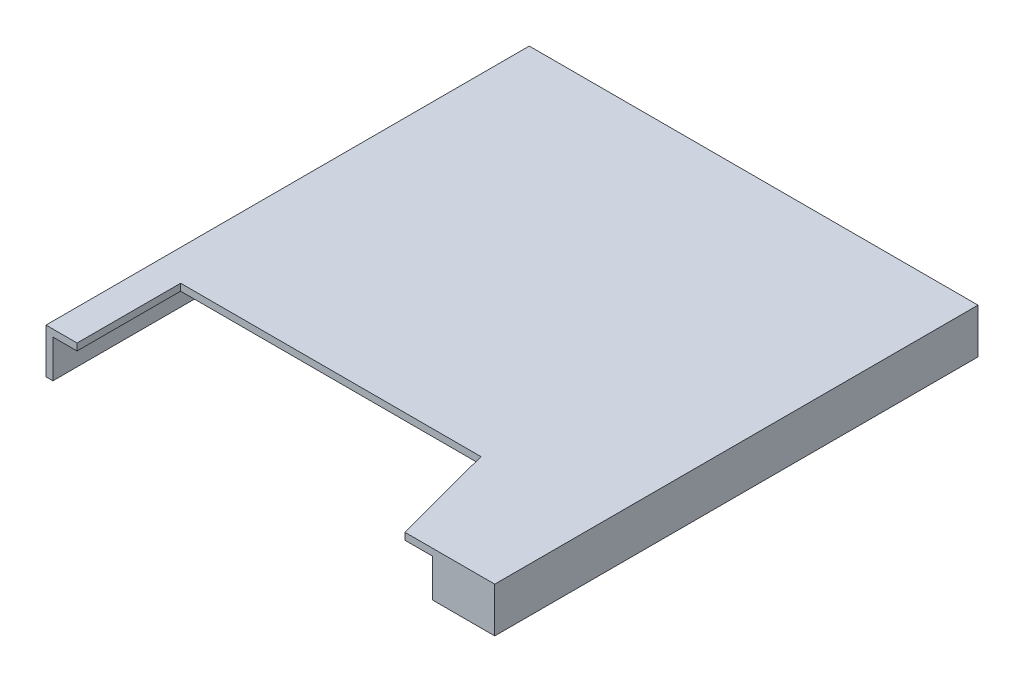
ISO-10303-21;
HEADER;
FILE_DESCRIPTION(('STEP AP214'),'2;1');
FILE_NAME('part.step','',(''),(''),'','','');
FILE_SCHEMA(('AUTOMOTIVE_DESIGN { 1 0 10303 214 1 1 1 1 }'));
ENDSEC;
DATA;
#1=APPLICATION_CONTEXT('core data for automotive mechanical design processes');
#2=APPLICATION_PROTOCOL_DEFINITION('international standard','automotive_design',2000,#1);
#3=PRODUCT_CONTEXT('',#1,'mechanical');
#4=PRODUCT('Part','Part','',(#3));
#5=PRODUCT_RELATED_PRODUCT_CATEGORY('part','',(#4));
#6=PRODUCT_DEFINITION_FORMATION('','',#4);
#7=PRODUCT_DEFINITION_CONTEXT('part definition',#1,'design');
#8=PRODUCT_DEFINITION('design','',#6,#7);
#9=PRODUCT_DEFINITION_SHAPE('','',#8);
#10=(LENGTH_UNIT() NAMED_UNIT(*) SI_UNIT(.MILLI.,.METRE.));
#11=(NAMED_UNIT(*) PLANE_ANGLE_UNIT() SI_UNIT($,.RADIAN.));
#12=(NAMED_UNIT(*) SI_UNIT($,.STERADIAN.) SOLID_ANGLE_UNIT());
#13=UNCERTAINTY_MEASURE_WITH_UNIT(LENGTH_MEASURE(1.E-05),#10,'distance_accuracy_value','');
#14=(GEOMETRIC_REPRESENTATION_CONTEXT(3) GLOBAL_UNCERTAINTY_ASSIGNED_CONTEXT((#13)) GLOBAL_UNIT_ASSIGNED_CONTEXT((#10,
#11,#12)) REPRESENTATION_CONTEXT('',''));
#15=CARTESIAN_POINT('',(0.,0.,0.));
#16=DIRECTION('',(0.,0.,1.));
#17=DIRECTION('',(1.,0.,0.));
#18=AXIS2_PLACEMENT_3D('',#15,#16,#17);
#19=CARTESIAN_POINT('',(0.,1.3,0.));
#20=DIRECTION('',(0.,1.,0.));
#21=DIRECTION('',(1.,0.,0.));
#22=AXIS2_PLACEMENT_3D('',#19,#20,#21);
#23=PLANE('',#22);
#24=DIRECTION('',(0.,0.,-1.));
#25=VECTOR('',#24,1.);
#26=CARTESIAN_POINT('',(6.5,1.3,0.));
#27=LINE('',#26,#25);
#28=CARTESIAN_POINT('',(6.5,1.3,7.));
#29=VERTEX_POINT('',#28);
#30=CARTESIAN_POINT('',(6.5,1.3,-7.));
#31=VERTEX_POINT('',#30);
#32=EDGE_CURVE('E11',#29,#31,#27,.T.);
#33=ORIENTED_EDGE('',*,*,#32,.T.);
#34=DIRECTION('',(-1.,0.,0.));
#35=VECTOR('',#34,1.);
#36=CARTESIAN_POINT('',(0.,1.3,-7.));
#37=LINE('',#36,#35);
#38=CARTESIAN_POINT('',(-6.5,1.3,-7.));
#39=VERTEX_POINT('',#38);
#40=EDGE_CURVE('E27',#31,#39,#37,.T.);
#41=ORIENTED_EDGE('',*,*,#40,.T.);
#42=DIRECTION('',(0.,0.,1.));
#43=VECTOR('',#42,1.);
#44=CARTESIAN_POINT('',(-6.5,1.3,0.));
#45=LINE('',#44,#43);
#46=CARTESIAN_POINT('',(-6.5,1.3,7.));
#47=VERTEX_POINT('',#46);
#48=EDGE_CURVE('E216',#39,#47,#45,.T.);
#49=ORIENTED_EDGE('',*,*,#48,.T.);
#50=DIRECTION('',(1.,0.,0.));
#51=VECTOR('',#50,1.);
#52=CARTESIAN_POINT('',(0.,1.3,7.));
#53=LINE('',#52,#51);
#54=CARTESIAN_POINT('',(-5.6,1.3,7.));
#55=VERTEX_POINT('',#54);
#56=EDGE_CURVE('E212',#47,#55,#53,.T.);
#57=ORIENTED_EDGE('',*,*,#56,.T.);
#58=DIRECTION('',(0.,0.,-1.));
#59=VECTOR('',#58,1.);
#60=CARTESIAN_POINT('',(-5.6,1.3,0.));
#61=LINE('',#60,#59);
#62=CARTESIAN_POINT('',(-5.6,1.3,4.));
#63=VERTEX_POINT('',#62);
#64=EDGE_CURVE('E217',#55,#63,#61,.T.);
#65=ORIENTED_EDGE('',*,*,#64,.T.);
#66=DIRECTION('',(1.,0.,0.));
#67=VECTOR('',#66,1.);
#68=CARTESIAN_POINT('',(0.,1.3,4.));
#69=LINE('',#68,#67);
#70=CARTESIAN_POINT('',(3.1,1.3,4.));
#71=VERTEX_POINT('',#70);
#72=EDGE_CURVE('E20',#63,#71,#69,.T.);
#73=ORIENTED_EDGE('',*,*,#72,.T.);
#74=DIRECTION('',(0.257662650560332,0.,0.966234939601246));
#75=VECTOR('',#74,1.);
#76=CARTESIAN_POINT('',(3.1,1.3,4.));
#77=LINE('',#76,#75);
#78=CARTESIAN_POINT('',(3.9,1.3,7.));
#79=VERTEX_POINT('',#78);
#80=EDGE_CURVE('E193',#71,#79,#77,.T.);
#81=ORIENTED_EDGE('',*,*,#80,.T.);
#82=DIRECTION('',(1.,0.,0.));
#83=VECTOR('',#82,1.);
#84=CARTESIAN_POINT('',(0.,1.3,7.));
#85=LINE('',#84,#83);
#86=EDGE_CURVE('E197',#79,#29,#85,.T.);
#87=ORIENTED_EDGE('',*,*,#86,.T.);
#88=EDGE_LOOP('',(#33,#41,#49,#57,#65,#73,#81,#87));
#89=FACE_BOUND('',#88,.T.);
#90=ADVANCED_FACE('F17',(#89),#23,.T.);
#91=CARTESIAN_POINT('',(6.5,0.,-7.));
#92=DIRECTION('',(0.,0.,-1.));
#93=DIRECTION('',(0.,-1.,0.));
#94=AXIS2_PLACEMENT_3D('',#91,#92,#93);
#95=PLANE('',#94);
#96=DIRECTION('',(-1.,0.,0.));
#97=VECTOR('',#96,1.);
#98=CARTESIAN_POINT('',(6.5,0.,-7.));
#99=LINE('',#98,#97);
#100=CARTESIAN_POINT('',(6.5,0.,-7.));
#101=VERTEX_POINT('',#100);
#102=CARTESIAN_POINT('',(-6.5,0.,-7.));
#103=VERTEX_POINT('',#102);
#104=EDGE_CURVE('E261',#101,#103,#99,.T.);
#105=ORIENTED_EDGE('',*,*,#104,.T.);
#106=DIRECTION('',(0.,1.,0.));
#107=VECTOR('',#106,1.);
#108=CARTESIAN_POINT('',(-6.5,0.,-7.));
#109=LINE('',#108,#107);
#110=EDGE_CURVE('E255',#103,#39,#109,.T.);
#111=ORIENTED_EDGE('',*,*,#110,.T.);
#112=ORIENTED_EDGE('',*,*,#40,.F.);
#113=DIRECTION('',(0.,-1.,0.));
#114=VECTOR('',#113,1.);
#115=CARTESIAN_POINT('',(6.5,0.,-7.));
#116=LINE('',#115,#114);
#117=EDGE_CURVE('E252',#31,#101,#116,.T.);
#118=ORIENTED_EDGE('',*,*,#117,.T.);
#119=EDGE_LOOP('',(#105,#111,#112,#118));
#120=FACE_BOUND('',#119,.T.);
#121=ADVANCED_FACE('F353',(#120),#95,.T.);
#122=CARTESIAN_POINT('',(6.5,0.,7.));
#123=DIRECTION('',(1.,0.,0.));
#124=DIRECTION('',(0.,1.,0.));
#125=AXIS2_PLACEMENT_3D('',#122,#123,#124);
#126=PLANE('',#125);
#127=DIRECTION('',(0.,0.,-1.));
#128=VECTOR('',#127,1.);
#129=CARTESIAN_POINT('',(6.5,0.,7.));
#130=LINE('',#129,#128);
#131=CARTESIAN_POINT('',(6.5,0.,7.));
#132=VERTEX_POINT('',#131);
#133=EDGE_CURVE('E248',#132,#101,#130,.T.);
#134=ORIENTED_EDGE('',*,*,#133,.T.);
#135=ORIENTED_EDGE('',*,*,#117,.F.);
#136=ORIENTED_EDGE('',*,*,#32,.F.);
#137=DIRECTION('',(0.,-1.,0.));
#138=VECTOR('',#137,1.);
#139=CARTESIAN_POINT('',(6.5,0.,7.));
#140=LINE('',#139,#138);
#141=EDGE_CURVE('E191',#29,#132,#140,.T.);
#142=ORIENTED_EDGE('',*,*,#141,.T.);
#143=EDGE_LOOP('',(#134,#135,#136,#142));
#144=FACE_BOUND('',#143,.T.);
#145=ADVANCED_FACE('F439',(#144),#126,.T.);
#146=CARTESIAN_POINT('',(-6.5,0.,7.));
#147=DIRECTION('',(0.,0.,1.));
#148=DIRECTION('',(1.,0.,0.));
#149=AXIS2_PLACEMENT_3D('',#146,#147,#148);
#150=PLANE('',#149);
#151=DIRECTION('',(0.,-1.,0.));
#152=VECTOR('',#151,1.);
#153=CARTESIAN_POINT('',(4.7,0.,7.));
#154=LINE('',#153,#152);
#155=CARTESIAN_POINT('',(4.7,1.1,7.));
#156=VERTEX_POINT('',#155);
#157=CARTESIAN_POINT('',(4.7,0.,7.));
#158=VERTEX_POINT('',#157);
#159=EDGE_CURVE('E155',#156,#158,#154,.T.);
#160=ORIENTED_EDGE('',*,*,#159,.T.);
#161=DIRECTION('',(1.,0.,0.));
#162=VECTOR('',#161,1.);
#163=CARTESIAN_POINT('',(-6.5,0.,7.));
#164=LINE('',#163,#162);
#165=EDGE_CURVE('E192',#158,#132,#164,.T.);
#166=ORIENTED_EDGE('',*,*,#165,.T.);
#167=ORIENTED_EDGE('',*,*,#141,.F.);
#168=ORIENTED_EDGE('',*,*,#86,.F.);
#169=DIRECTION('',(0.,-1.,0.));
#170=VECTOR('',#169,1.);
#171=CARTESIAN_POINT('',(3.9,0.,7.));
#172=LINE('',#171,#170);
#173=CARTESIAN_POINT('',(3.9,1.1,7.));
#174=VERTEX_POINT('',#173);
#175=EDGE_CURVE('E231',#79,#174,#172,.T.);
#176=ORIENTED_EDGE('',*,*,#175,.T.);
#177=DIRECTION('',(1.,0.,0.));
#178=VECTOR('',#177,1.);
#179=CARTESIAN_POINT('',(0.,1.1,7.));
#180=LINE('',#179,#178);
#181=EDGE_CURVE('E271',#174,#156,#180,.T.);
#182=ORIENTED_EDGE('',*,*,#181,.T.);
#183=EDGE_LOOP('',(#160,#166,#167,#168,#176,#182));
#184=FACE_BOUND('',#183,.T.);
#185=ADVANCED_FACE('F316',(#184),#150,.T.);
#186=CARTESIAN_POINT('',(3.1,1.3,4.));
#187=DIRECTION('',(0.966234939601246,0.,-0.257662650560333));
#188=DIRECTION('',(0.,-1.,0.));
#189=AXIS2_PLACEMENT_3D('',#186,#187,#188);
#190=PLANE('',#189);
#191=ORIENTED_EDGE('',*,*,#80,.F.);
#192=DIRECTION('',(0.,1.,0.));
#193=VECTOR('',#192,1.);
#194=CARTESIAN_POINT('',(3.1,1.3,4.));
#195=LINE('',#194,#193);
#196=CARTESIAN_POINT('',(3.1,1.1,4.));
#197=VERTEX_POINT('',#196);
#198=EDGE_CURVE('E267',#197,#71,#195,.T.);
#199=ORIENTED_EDGE('',*,*,#198,.F.);
#200=DIRECTION('',(-0.257662650560333,0.,-0.966234939601246));
#201=VECTOR('',#200,1.);
#202=CARTESIAN_POINT('',(3.1,1.1,4.));
#203=LINE('',#202,#201);
#204=EDGE_CURVE('E149',#174,#197,#203,.T.);
#205=ORIENTED_EDGE('',*,*,#204,.F.);
#206=ORIENTED_EDGE('',*,*,#175,.F.);
#207=EDGE_LOOP('',(#191,#199,#205,#206));
#208=FACE_BOUND('',#207,.T.);
#209=ADVANCED_FACE('F438',(#208),#190,.F.);
#210=CARTESIAN_POINT('',(-5.6,1.3,4.));
#211=DIRECTION('',(0.,0.,-1.));
#212=DIRECTION('',(-1.,0.,0.));
#213=AXIS2_PLACEMENT_3D('',#210,#211,#212);
#214=PLANE('',#213);
#215=ORIENTED_EDGE('',*,*,#72,.F.);
#216=DIRECTION('',(0.,1.,0.));
#217=VECTOR('',#216,1.);
#218=CARTESIAN_POINT('',(-5.6,1.3,4.));
#219=LINE('',#218,#217);
#220=CARTESIAN_POINT('',(-5.6,1.1,4.));
#221=VERTEX_POINT('',#220);
#222=EDGE_CURVE('E210',#221,#63,#219,.T.);
#223=ORIENTED_EDGE('',*,*,#222,.F.);
#224=DIRECTION('',(-1.,0.,0.));
#225=VECTOR('',#224,1.);
#226=CARTESIAN_POINT('',(-5.6,1.1,4.));
#227=LINE('',#226,#225);
#228=EDGE_CURVE('E182',#197,#221,#227,.T.);
#229=ORIENTED_EDGE('',*,*,#228,.F.);
#230=ORIENTED_EDGE('',*,*,#198,.T.);
#231=EDGE_LOOP('',(#215,#223,#229,#230));
#232=FACE_BOUND('',#231,.T.);
#233=ADVANCED_FACE('F447',(#232),#214,.F.);
#234=CARTESIAN_POINT('',(-5.6,1.3,7.));
#235=DIRECTION('',(-1.,0.,0.));
#236=DIRECTION('',(0.,0.,1.));
#237=AXIS2_PLACEMENT_3D('',#234,#235,#236);
#238=PLANE('',#237);
#239=ORIENTED_EDGE('',*,*,#64,.F.);
#240=DIRECTION('',(0.,1.,0.));
#241=VECTOR('',#240,1.);
#242=CARTESIAN_POINT('',(-5.6,1.3,7.));
#243=LINE('',#242,#241);
#244=CARTESIAN_POINT('',(-5.6,1.1,7.));
#245=VERTEX_POINT('',#244);
#246=EDGE_CURVE('E188',#245,#55,#243,.T.);
#247=ORIENTED_EDGE('',*,*,#246,.F.);
#248=DIRECTION('',(0.,0.,1.));
#249=VECTOR('',#248,1.);
#250=CARTESIAN_POINT('',(-5.6,1.1,7.));
#251=LINE('',#250,#249);
#252=EDGE_CURVE('E171',#221,#245,#251,.T.);
#253=ORIENTED_EDGE('',*,*,#252,.F.);
#254=ORIENTED_EDGE('',*,*,#222,.T.);
#255=EDGE_LOOP('',(#239,#247,#253,#254));
#256=FACE_BOUND('',#255,.T.);
#257=ADVANCED_FACE('F426',(#256),#238,.F.);
#258=CARTESIAN_POINT('',(-6.5,0.,7.));
#259=DIRECTION('',(0.,0.,1.));
#260=DIRECTION('',(1.,0.,0.));
#261=AXIS2_PLACEMENT_3D('',#258,#259,#260);
#262=PLANE('',#261);
#263=DIRECTION('',(0.,-1.,0.));
#264=VECTOR('',#263,1.);
#265=CARTESIAN_POINT('',(-6.5,0.,7.));
#266=LINE('',#265,#264);
#267=CARTESIAN_POINT('',(-6.5,0.,7.));
#268=VERTEX_POINT('',#267);
#269=EDGE_CURVE('E206',#47,#268,#266,.T.);
#270=ORIENTED_EDGE('',*,*,#269,.T.);
#271=DIRECTION('',(1.,0.,0.));
#272=VECTOR('',#271,1.);
#273=CARTESIAN_POINT('',(-6.5,0.,7.));
#274=LINE('',#273,#272);
#275=CARTESIAN_POINT('',(-6.3,0.,7.));
#276=VERTEX_POINT('',#275);
#277=EDGE_CURVE('E211',#268,#276,#274,.T.);
#278=ORIENTED_EDGE('',*,*,#277,.T.);
#279=DIRECTION('',(0.,1.,0.));
#280=VECTOR('',#279,1.);
#281=CARTESIAN_POINT('',(-6.3,0.,7.));
#282=LINE('',#281,#280);
#283=CARTESIAN_POINT('',(-6.3,1.1,7.));
#284=VERTEX_POINT('',#283);
#285=EDGE_CURVE('E237',#276,#284,#282,.T.);
#286=ORIENTED_EDGE('',*,*,#285,.T.);
#287=DIRECTION('',(1.,0.,0.));
#288=VECTOR('',#287,1.);
#289=CARTESIAN_POINT('',(-6.5,1.1,7.));
#290=LINE('',#289,#288);
#291=EDGE_CURVE('E245',#284,#245,#290,.T.);
#292=ORIENTED_EDGE('',*,*,#291,.T.);
#293=ORIENTED_EDGE('',*,*,#246,.T.);
#294=ORIENTED_EDGE('',*,*,#56,.F.);
#295=EDGE_LOOP('',(#270,#278,#286,#292,#293,#294));
#296=FACE_BOUND('',#295,.T.);
#297=ADVANCED_FACE('F422',(#296),#262,.T.);
#298=CARTESIAN_POINT('',(-6.5,0.,-7.));
#299=DIRECTION('',(-1.,0.,0.));
#300=DIRECTION('',(0.,0.,1.));
#301=AXIS2_PLACEMENT_3D('',#298,#299,#300);
#302=PLANE('',#301);
#303=DIRECTION('',(0.,0.,1.));
#304=VECTOR('',#303,1.);
#305=CARTESIAN_POINT('',(-6.5,0.,-7.));
#306=LINE('',#305,#304);
#307=EDGE_CURVE('E184',#103,#268,#306,.T.);
#308=ORIENTED_EDGE('',*,*,#307,.T.);
#309=ORIENTED_EDGE('',*,*,#269,.F.);
#310=ORIENTED_EDGE('',*,*,#48,.F.);
#311=ORIENTED_EDGE('',*,*,#110,.F.);
#312=EDGE_LOOP('',(#308,#309,#310,#311));
#313=FACE_BOUND('',#312,.T.);
#314=ADVANCED_FACE('F404',(#313),#302,.T.);
#315=CARTESIAN_POINT('',(0.,0.,0.));
#316=DIRECTION('',(0.,1.,0.));
#317=DIRECTION('',(1.,0.,0.));
#318=AXIS2_PLACEMENT_3D('',#315,#316,#317);
#319=PLANE('',#318);
#320=ORIENTED_EDGE('',*,*,#307,.F.);
#321=ORIENTED_EDGE('',*,*,#104,.F.);
#322=ORIENTED_EDGE('',*,*,#133,.F.);
#323=ORIENTED_EDGE('',*,*,#165,.F.);
#324=DIRECTION('',(0.,0.,1.));
#325=VECTOR('',#324,1.);
#326=CARTESIAN_POINT('',(4.7,0.,0.));
#327=LINE('',#326,#325);
#328=CARTESIAN_POINT('',(4.7,0.,6.8));
#329=VERTEX_POINT('',#328);
#330=EDGE_CURVE('E159',#329,#158,#327,.T.);
#331=ORIENTED_EDGE('',*,*,#330,.F.);
#332=DIRECTION('',(-1.,0.,0.));
#333=VECTOR('',#332,1.);
#334=CARTESIAN_POINT('',(0.,0.,6.8));
#335=LINE('',#334,#333);
#336=CARTESIAN_POINT('',(6.3,0.,6.8));
#337=VERTEX_POINT('',#336);
#338=EDGE_CURVE('E143',#337,#329,#335,.T.);
#339=ORIENTED_EDGE('',*,*,#338,.F.);
#340=DIRECTION('',(0.,0.,1.));
#341=VECTOR('',#340,1.);
#342=CARTESIAN_POINT('',(6.3,0.,0.));
#343=LINE('',#342,#341);
#344=CARTESIAN_POINT('',(6.3,0.,-6.8));
#345=VERTEX_POINT('',#344);
#346=EDGE_CURVE('E174',#345,#337,#343,.T.);
#347=ORIENTED_EDGE('',*,*,#346,.F.);
#348=DIRECTION('',(1.,0.,0.));
#349=VECTOR('',#348,1.);
#350=CARTESIAN_POINT('',(0.,0.,-6.8));
#351=LINE('',#350,#349);
#352=CARTESIAN_POINT('',(-6.3,0.,-6.8));
#353=VERTEX_POINT('',#352);
#354=EDGE_CURVE('E202',#353,#345,#351,.T.);
#355=ORIENTED_EDGE('',*,*,#354,.F.);
#356=DIRECTION('',(0.,0.,-1.));
#357=VECTOR('',#356,1.);
#358=CARTESIAN_POINT('',(-6.3,0.,0.));
#359=LINE('',#358,#357);
#360=EDGE_CURVE('E180',#276,#353,#359,.T.);
#361=ORIENTED_EDGE('',*,*,#360,.F.);
#362=ORIENTED_EDGE('',*,*,#277,.F.);
#363=EDGE_LOOP('',(#320,#321,#322,#323,#331,#339,#347,#355,#361,#362));
#364=FACE_BOUND('',#363,.T.);
#365=ADVANCED_FACE('F306',(#364),#319,.F.);
#366=CARTESIAN_POINT('',(4.7,1.1,7.));
#367=DIRECTION('',(-1.,0.,0.));
#368=DIRECTION('',(0.,0.,1.));
#369=AXIS2_PLACEMENT_3D('',#366,#367,#368);
#370=PLANE('',#369);
#371=ORIENTED_EDGE('',*,*,#330,.T.);
#372=ORIENTED_EDGE('',*,*,#159,.F.);
#373=DIRECTION('',(0.,0.,-1.));
#374=VECTOR('',#373,1.);
#375=CARTESIAN_POINT('',(4.7,1.1,7.));
#376=LINE('',#375,#374);
#377=CARTESIAN_POINT('',(4.7,1.1,6.8));
#378=VERTEX_POINT('',#377);
#379=EDGE_CURVE('E148',#156,#378,#376,.T.);
#380=ORIENTED_EDGE('',*,*,#379,.T.);
#381=DIRECTION('',(0.,-1.,0.));
#382=VECTOR('',#381,1.);
#383=CARTESIAN_POINT('',(4.7,1.1,6.8));
#384=LINE('',#383,#382);
#385=EDGE_CURVE('E135',#378,#329,#384,.T.);
#386=ORIENTED_EDGE('',*,*,#385,.T.);
#387=EDGE_LOOP('',(#371,#372,#380,#386));
#388=FACE_BOUND('',#387,.T.);
#389=ADVANCED_FACE('F153',(#388),#370,.T.);
#390=CARTESIAN_POINT('',(0.,1.1,0.));
#391=DIRECTION('',(0.,1.,0.));
#392=DIRECTION('',(1.,0.,0.));
#393=AXIS2_PLACEMENT_3D('',#390,#391,#392);
#394=PLANE('',#393);
#395=ORIENTED_EDGE('',*,*,#181,.F.);
#396=ORIENTED_EDGE('',*,*,#204,.T.);
#397=ORIENTED_EDGE('',*,*,#228,.T.);
#398=ORIENTED_EDGE('',*,*,#252,.T.);
#399=ORIENTED_EDGE('',*,*,#291,.F.);
#400=DIRECTION('',(0.,0.,1.));
#401=VECTOR('',#400,1.);
#402=CARTESIAN_POINT('',(-6.3,1.1,0.));
#403=LINE('',#402,#401);
#404=CARTESIAN_POINT('',(-6.3,1.1,-6.8));
#405=VERTEX_POINT('',#404);
#406=EDGE_CURVE('E203',#405,#284,#403,.T.);
#407=ORIENTED_EDGE('',*,*,#406,.F.);
#408=DIRECTION('',(-1.,0.,0.));
#409=VECTOR('',#408,1.);
#410=CARTESIAN_POINT('',(0.,1.1,-6.8));
#411=LINE('',#410,#409);
#412=CARTESIAN_POINT('',(6.3,1.1,-6.8));
#413=VERTEX_POINT('',#412);
#414=EDGE_CURVE('E222',#413,#405,#411,.T.);
#415=ORIENTED_EDGE('',*,*,#414,.F.);
#416=DIRECTION('',(0.,0.,-1.));
#417=VECTOR('',#416,1.);
#418=CARTESIAN_POINT('',(6.3,1.1,0.));
#419=LINE('',#418,#417);
#420=CARTESIAN_POINT('',(6.3,1.1,6.8));
#421=VERTEX_POINT('',#420);
#422=EDGE_CURVE('E163',#421,#413,#419,.T.);
#423=ORIENTED_EDGE('',*,*,#422,.F.);
#424=DIRECTION('',(1.,0.,0.));
#425=VECTOR('',#424,1.);
#426=CARTESIAN_POINT('',(0.,1.1,6.8));
#427=LINE('',#426,#425);
#428=EDGE_CURVE('E140',#378,#421,#427,.T.);
#429=ORIENTED_EDGE('',*,*,#428,.F.);
#430=ORIENTED_EDGE('',*,*,#379,.F.);
#431=EDGE_LOOP('',(#395,#396,#397,#398,#399,#407,#415,#423,#429,#430));
#432=FACE_BOUND('',#431,.T.);
#433=ADVANCED_FACE('F161',(#432),#394,.F.);
#434=CARTESIAN_POINT('',(4.7,1.1,6.8));
#435=DIRECTION('',(0.,0.,-1.));
#436=DIRECTION('',(0.,-1.,0.));
#437=AXIS2_PLACEMENT_3D('',#434,#435,#436);
#438=PLANE('',#437);
#439=ORIENTED_EDGE('',*,*,#338,.T.);
#440=ORIENTED_EDGE('',*,*,#385,.F.);
#441=ORIENTED_EDGE('',*,*,#428,.T.);
#442=DIRECTION('',(0.,-1.,0.));
#443=VECTOR('',#442,1.);
#444=CARTESIAN_POINT('',(6.3,1.1,6.8));
#445=LINE('',#444,#443);
#446=EDGE_CURVE('E165',#421,#337,#445,.T.);
#447=ORIENTED_EDGE('',*,*,#446,.T.);
#448=EDGE_LOOP('',(#439,#440,#441,#447));
#449=FACE_BOUND('',#448,.T.);
#450=ADVANCED_FACE('F137',(#449),#438,.T.);
#451=CARTESIAN_POINT('',(6.3,0.,7.));
#452=DIRECTION('',(1.,0.,0.));
#453=DIRECTION('',(0.,1.,0.));
#454=AXIS2_PLACEMENT_3D('',#451,#452,#453);
#455=PLANE('',#454);
#456=DIRECTION('',(0.,1.,0.));
#457=VECTOR('',#456,1.);
#458=CARTESIAN_POINT('',(6.3,0.,-6.8));
#459=LINE('',#458,#457);
#460=EDGE_CURVE('E198',#345,#413,#459,.T.);
#461=ORIENTED_EDGE('',*,*,#460,.F.);
#462=ORIENTED_EDGE('',*,*,#346,.T.);
#463=ORIENTED_EDGE('',*,*,#446,.F.);
#464=ORIENTED_EDGE('',*,*,#422,.T.);
#465=EDGE_LOOP('',(#461,#462,#463,#464));
#466=FACE_BOUND('',#465,.T.);
#467=ADVANCED_FACE('F311',(#466),#455,.F.);
#468=CARTESIAN_POINT('',(6.5,0.,-6.8));
#469=DIRECTION('',(0.,0.,-1.));
#470=DIRECTION('',(0.,-1.,0.));
#471=AXIS2_PLACEMENT_3D('',#468,#469,#470);
#472=PLANE('',#471);
#473=ORIENTED_EDGE('',*,*,#414,.T.);
#474=DIRECTION('',(0.,1.,0.));
#475=VECTOR('',#474,1.);
#476=CARTESIAN_POINT('',(-6.3,0.,-6.8));
#477=LINE('',#476,#475);
#478=EDGE_CURVE('E177',#353,#405,#477,.T.);
#479=ORIENTED_EDGE('',*,*,#478,.F.);
#480=ORIENTED_EDGE('',*,*,#354,.T.);
#481=ORIENTED_EDGE('',*,*,#460,.T.);
#482=EDGE_LOOP('',(#473,#479,#480,#481));
#483=FACE_BOUND('',#482,.T.);
#484=ADVANCED_FACE('F309',(#483),#472,.F.);
#485=CARTESIAN_POINT('',(-6.3,0.,-7.));
#486=DIRECTION('',(-1.,0.,0.));
#487=DIRECTION('',(0.,0.,1.));
#488=AXIS2_PLACEMENT_3D('',#485,#486,#487);
#489=PLANE('',#488);
#490=ORIENTED_EDGE('',*,*,#406,.T.);
#491=ORIENTED_EDGE('',*,*,#285,.F.);
#492=ORIENTED_EDGE('',*,*,#360,.T.);
#493=ORIENTED_EDGE('',*,*,#478,.T.);
#494=EDGE_LOOP('',(#490,#491,#492,#493));
#495=FACE_BOUND('',#494,.T.);
#496=ADVANCED_FACE('F301',(#495),#489,.F.);
#497=CLOSED_SHELL('',(#90,#121,#145,#185,#209,#233,#257,#297,#314,#365,#389,#433,#450,#467,#484,#496));
#498=MANIFOLD_SOLID_BREP('B1',#497);
#499=ADVANCED_BREP_SHAPE_REPRESENTATION('',(#18,#498),#14);
#500=SHAPE_DEFINITION_REPRESENTATION(#9,#499);
ENDSEC;
END-ISO-10303-21;
